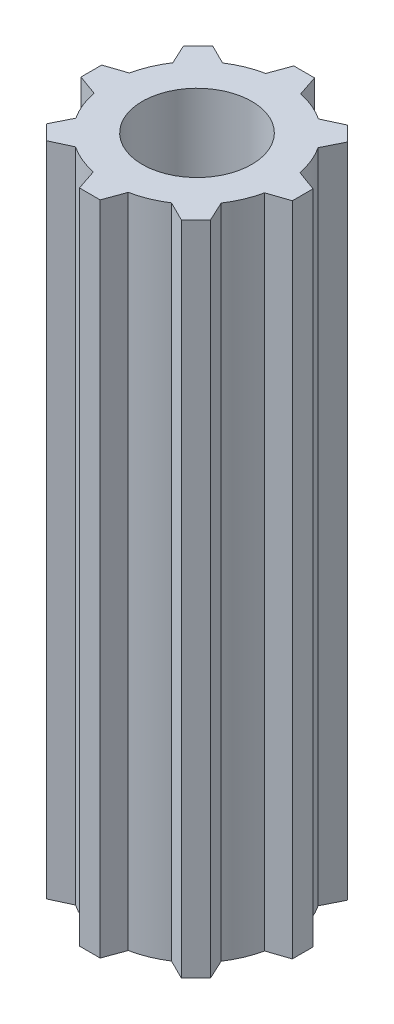
ISO-10303-21;
HEADER;
FILE_DESCRIPTION(('STEP AP214'),'2;1');
FILE_NAME('part.step','',(''),(''),'','','');
FILE_SCHEMA(('AUTOMOTIVE_DESIGN { 1 0 10303 214 1 1 1 1 }'));
ENDSEC;
DATA;
#1=APPLICATION_CONTEXT('core data for automotive mechanical design processes');
#2=APPLICATION_PROTOCOL_DEFINITION('international standard','automotive_design',2000,#1);
#3=PRODUCT_CONTEXT('',#1,'mechanical');
#4=PRODUCT('Part','Part','',(#3));
#5=PRODUCT_RELATED_PRODUCT_CATEGORY('part','',(#4));
#6=PRODUCT_DEFINITION_FORMATION('','',#4);
#7=PRODUCT_DEFINITION_CONTEXT('part definition',#1,'design');
#8=PRODUCT_DEFINITION('design','',#6,#7);
#9=PRODUCT_DEFINITION_SHAPE('','',#8);
#10=(LENGTH_UNIT() NAMED_UNIT(*) SI_UNIT(.MILLI.,.METRE.));
#11=(NAMED_UNIT(*) PLANE_ANGLE_UNIT() SI_UNIT($,.RADIAN.));
#12=(NAMED_UNIT(*) SI_UNIT($,.STERADIAN.) SOLID_ANGLE_UNIT());
#13=UNCERTAINTY_MEASURE_WITH_UNIT(LENGTH_MEASURE(1.E-05),#10,'distance_accuracy_value','');
#14=(GEOMETRIC_REPRESENTATION_CONTEXT(3) GLOBAL_UNCERTAINTY_ASSIGNED_CONTEXT((#13)) GLOBAL_UNIT_ASSIGNED_CONTEXT((#10,
#11,#12)) REPRESENTATION_CONTEXT('',''));
#15=CARTESIAN_POINT('',(0.,0.,0.));
#16=DIRECTION('',(0.,0.,1.));
#17=DIRECTION('',(1.,0.,0.));
#18=AXIS2_PLACEMENT_3D('',#15,#16,#17);
#19=CARTESIAN_POINT('',(0.,38.1,0.));
#20=DIRECTION('',(0.,-1.,0.));
#21=DIRECTION('',(0.,0.,-1.));
#22=AXIS2_PLACEMENT_3D('',#19,#20,#21);
#23=CYLINDRICAL_SURFACE('',#22,5.08);
#24=CARTESIAN_POINT('',(0.,0.,0.));
#25=DIRECTION('',(0.,1.,0.));
#26=DIRECTION('',(0.,0.,1.));
#27=AXIS2_PLACEMENT_3D('',#24,#25,#26);
#28=CIRCLE('',#27,5.08);
#29=CARTESIAN_POINT('',(2.82151602166992,0.,-4.22438721466912));
#30=VERTEX_POINT('',#29);
#31=CARTESIAN_POINT('',(1.04749297734917,0.,-4.97083076179467));
#32=VERTEX_POINT('',#31);
#33=EDGE_CURVE('E279',#30,#32,#28,.T.);
#34=ORIENTED_EDGE('',*,*,#33,.T.);
#35=DIRECTION('',(0.,-1.,0.));
#36=VECTOR('',#35,1.);
#37=CARTESIAN_POINT('',(1.04749297734917,38.1,-4.97083076179467));
#38=LINE('',#37,#36);
#39=CARTESIAN_POINT('',(1.04749297734917,38.1,-4.97083076179467));
#40=VERTEX_POINT('',#39);
#41=EDGE_CURVE('E11',#40,#32,#38,.T.);
#42=ORIENTED_EDGE('',*,*,#41,.F.);
#43=CARTESIAN_POINT('',(0.,38.1,0.));
#44=DIRECTION('',(0.,1.,0.));
#45=DIRECTION('',(0.,0.,1.));
#46=AXIS2_PLACEMENT_3D('',#43,#44,#45);
#47=CIRCLE('',#46,5.08);
#48=CARTESIAN_POINT('',(2.82151602166992,38.1,-4.22438721466912));
#49=VERTEX_POINT('',#48);
#50=EDGE_CURVE('E342',#49,#40,#47,.T.);
#51=ORIENTED_EDGE('',*,*,#50,.F.);
#52=DIRECTION('',(0.,-1.,0.));
#53=VECTOR('',#52,1.);
#54=CARTESIAN_POINT('',(2.82151602166992,38.1,-4.22438721466912));
#55=LINE('',#54,#53);
#56=EDGE_CURVE('E275',#49,#30,#55,.T.);
#57=ORIENTED_EDGE('',*,*,#56,.T.);
#58=EDGE_LOOP('',(#34,#42,#51,#57));
#59=FACE_BOUND('',#58,.T.);
#60=ADVANCED_FACE('F39',(#59),#23,.T.);
#61=CARTESIAN_POINT('',(1.04749297734917,38.1,-4.97083076179467));
#62=DIRECTION('',(-0.948425843861846,0.,0.316999083113728));
#63=DIRECTION('',(0.316999083113728,0.,0.948425843861847));
#64=AXIS2_PLACEMENT_3D('',#61,#62,#63);
#65=PLANE('',#64);
#66=DIRECTION('',(-0.316999083113728,0.,-0.948425843861846));
#67=VECTOR('',#66,1.);
#68=CARTESIAN_POINT('',(1.04749297734917,0.,-4.97083076179467));
#69=LINE('',#68,#67);
#70=CARTESIAN_POINT('',(0.644904141794734,0.,-6.17533158349921));
#71=VERTEX_POINT('',#70);
#72=EDGE_CURVE('E282',#32,#71,#69,.T.);
#73=ORIENTED_EDGE('',*,*,#72,.T.);
#74=DIRECTION('',(0.,-1.,0.));
#75=VECTOR('',#74,1.);
#76=CARTESIAN_POINT('',(0.644904141794734,38.1,-6.17533158349921));
#77=LINE('',#76,#75);
#78=CARTESIAN_POINT('',(0.644904141794734,38.1,-6.17533158349921));
#79=VERTEX_POINT('',#78);
#80=EDGE_CURVE('E47',#79,#71,#77,.T.);
#81=ORIENTED_EDGE('',*,*,#80,.F.);
#82=DIRECTION('',(-0.316999083113728,0.,-0.948425843861846));
#83=VECTOR('',#82,1.);
#84=CARTESIAN_POINT('',(1.04749297734917,38.1,-4.97083076179467));
#85=LINE('',#84,#83);
#86=EDGE_CURVE('E170',#40,#79,#85,.T.);
#87=ORIENTED_EDGE('',*,*,#86,.F.);
#88=ORIENTED_EDGE('',*,*,#41,.T.);
#89=EDGE_LOOP('',(#73,#81,#87,#88));
#90=FACE_BOUND('',#89,.T.);
#91=ADVANCED_FACE('F521',(#90),#65,.F.);
#92=CARTESIAN_POINT('',(0.644904141794734,38.1,-6.17533158349921));
#93=DIRECTION('',(0.,0.,1.));
#94=DIRECTION('',(1.,0.,0.));
#95=AXIS2_PLACEMENT_3D('',#92,#93,#94);
#96=PLANE('',#95);
#97=DIRECTION('',(-1.,0.,0.));
#98=VECTOR('',#97,1.);
#99=CARTESIAN_POINT('',(0.644904141794734,0.,-6.17533158349921));
#100=LINE('',#99,#98);
#101=CARTESIAN_POINT('',(-0.556834652404989,0.,-6.17533158349921));
#102=VERTEX_POINT('',#101);
#103=EDGE_CURVE('E285',#71,#102,#100,.T.);
#104=ORIENTED_EDGE('',*,*,#103,.T.);
#105=DIRECTION('',(0.,-1.,0.));
#106=VECTOR('',#105,1.);
#107=CARTESIAN_POINT('',(-0.556834652404989,38.1,-6.17533158349921));
#108=LINE('',#107,#106);
#109=CARTESIAN_POINT('',(-0.556834652404989,38.1,-6.17533158349921));
#110=VERTEX_POINT('',#109);
#111=EDGE_CURVE('E421',#110,#102,#108,.T.);
#112=ORIENTED_EDGE('',*,*,#111,.F.);
#113=DIRECTION('',(-1.,0.,0.));
#114=VECTOR('',#113,1.);
#115=CARTESIAN_POINT('',(0.644904141794734,38.1,-6.17533158349921));
#116=LINE('',#115,#114);
#117=EDGE_CURVE('E429',#79,#110,#116,.T.);
#118=ORIENTED_EDGE('',*,*,#117,.F.);
#119=ORIENTED_EDGE('',*,*,#80,.T.);
#120=EDGE_LOOP('',(#104,#112,#118,#119));
#121=FACE_BOUND('',#120,.T.);
#122=ADVANCED_FACE('F427',(#121),#96,.F.);
#123=CARTESIAN_POINT('',(-0.991979733700994,38.1,-4.98220595799958));
#124=DIRECTION('',(0.939468996456405,0.,0.342633922280319));
#125=DIRECTION('',(0.342633922280319,0.,-0.939468996456405));
#126=AXIS2_PLACEMENT_3D('',#123,#124,#125);
#127=PLANE('',#126);
#128=DIRECTION('',(-0.342633922280319,0.,0.939468996456405));
#129=VECTOR('',#128,1.);
#130=CARTESIAN_POINT('',(-0.991979733700994,0.,-4.98220595799958));
#131=LINE('',#130,#129);
#132=CARTESIAN_POINT('',(-0.991979733700992,0.,-4.98220595799958));
#133=VERTEX_POINT('',#132);
#134=EDGE_CURVE('E287',#102,#133,#131,.T.);
#135=ORIENTED_EDGE('',*,*,#134,.T.);
#136=DIRECTION('',(0.,-1.,0.));
#137=VECTOR('',#136,1.);
#138=CARTESIAN_POINT('',(-0.991979733700992,38.1,-4.98220595799958));
#139=LINE('',#138,#137);
#140=CARTESIAN_POINT('',(-0.991979733700992,38.1,-4.98220595799958));
#141=VERTEX_POINT('',#140);
#142=EDGE_CURVE('E418',#141,#133,#139,.T.);
#143=ORIENTED_EDGE('',*,*,#142,.F.);
#144=DIRECTION('',(-0.342633922280319,0.,0.939468996456405));
#145=VECTOR('',#144,1.);
#146=CARTESIAN_POINT('',(-0.991979733700994,38.1,-4.98220595799958));
#147=LINE('',#146,#145);
#148=EDGE_CURVE('E447',#110,#141,#147,.T.);
#149=ORIENTED_EDGE('',*,*,#148,.F.);
#150=ORIENTED_EDGE('',*,*,#111,.T.);
#151=EDGE_LOOP('',(#135,#143,#149,#150));
#152=FACE_BOUND('',#151,.T.);
#153=ADVANCED_FACE('F438',(#152),#127,.F.);
#154=CARTESIAN_POINT('',(0.,38.1,0.));
#155=DIRECTION('',(0.,-1.,0.));
#156=DIRECTION('',(0.,0.,-1.));
#157=AXIS2_PLACEMENT_3D('',#154,#155,#156);
#158=CYLINDRICAL_SURFACE('',#157,5.08);
#159=CARTESIAN_POINT('',(0.,0.,0.));
#160=DIRECTION('',(0.,1.,0.));
#161=DIRECTION('',(0.,0.,1.));
#162=AXIS2_PLACEMENT_3D('',#159,#160,#161);
#163=CIRCLE('',#162,5.08);
#164=CARTESIAN_POINT('',(-2.77421875226682,0.,-4.25559752732459));
#165=VERTEX_POINT('',#164);
#166=EDGE_CURVE('E289',#133,#165,#163,.T.);
#167=ORIENTED_EDGE('',*,*,#166,.T.);
#168=DIRECTION('',(0.,-1.,0.));
#169=VECTOR('',#168,1.);
#170=CARTESIAN_POINT('',(-2.77421875226682,38.1,-4.25559752732459));
#171=LINE('',#170,#169);
#172=CARTESIAN_POINT('',(-2.77421875226682,38.1,-4.25559752732459));
#173=VERTEX_POINT('',#172);
#174=EDGE_CURVE('E415',#173,#165,#171,.T.);
#175=ORIENTED_EDGE('',*,*,#174,.F.);
#176=CARTESIAN_POINT('',(0.,38.1,0.));
#177=DIRECTION('',(0.,1.,0.));
#178=DIRECTION('',(0.,0.,1.));
#179=AXIS2_PLACEMENT_3D('',#176,#177,#178);
#180=CIRCLE('',#179,5.08);
#181=EDGE_CURVE('E444',#141,#173,#180,.T.);
#182=ORIENTED_EDGE('',*,*,#181,.F.);
#183=ORIENTED_EDGE('',*,*,#142,.T.);
#184=EDGE_LOOP('',(#167,#175,#182,#183));
#185=FACE_BOUND('',#184,.T.);
#186=ADVANCED_FACE('F442',(#185),#158,.T.);
#187=CARTESIAN_POINT('',(-2.77421875226682,38.1,-4.25559752732459));
#188=DIRECTION('',(-0.44648614434765,0.,0.89479054694692));
#189=DIRECTION('',(0.894790546946921,0.,0.446486144347651));
#190=AXIS2_PLACEMENT_3D('',#187,#188,#189);
#191=PLANE('',#190);
#192=DIRECTION('',(-0.89479054694692,0.,-0.44648614434765));
#193=VECTOR('',#192,1.);
#194=CARTESIAN_POINT('',(-2.77421875226682,0.,-4.25559752732459));
#195=LINE('',#194,#193);
#196=CARTESIAN_POINT('',(-3.91060274688941,0.,-4.8226349306461));
#197=VERTEX_POINT('',#196);
#198=EDGE_CURVE('E291',#165,#197,#195,.T.);
#199=ORIENTED_EDGE('',*,*,#198,.T.);
#200=DIRECTION('',(0.,-1.,0.));
#201=VECTOR('',#200,1.);
#202=CARTESIAN_POINT('',(-3.91060274688941,38.1,-4.8226349306461));
#203=LINE('',#202,#201);
#204=CARTESIAN_POINT('',(-3.91060274688941,38.1,-4.8226349306461));
#205=VERTEX_POINT('',#204);
#206=EDGE_CURVE('E412',#205,#197,#203,.T.);
#207=ORIENTED_EDGE('',*,*,#206,.F.);
#208=DIRECTION('',(-0.89479054694692,0.,-0.44648614434765));
#209=VECTOR('',#208,1.);
#210=CARTESIAN_POINT('',(-2.77421875226682,38.1,-4.25559752732459));
#211=LINE('',#210,#209);
#212=EDGE_CURVE('E446',#173,#205,#211,.T.);
#213=ORIENTED_EDGE('',*,*,#212,.F.);
#214=ORIENTED_EDGE('',*,*,#174,.T.);
#215=EDGE_LOOP('',(#199,#207,#213,#214));
#216=FACE_BOUND('',#215,.T.);
#217=ADVANCED_FACE('F534',(#216),#191,.F.);
#218=CARTESIAN_POINT('',(-3.91060274688941,38.1,-4.8226349306461));
#219=DIRECTION('',(0.707106781186548,0.,0.707106781186547));
#220=DIRECTION('',(0.707106781186547,0.,-0.707106781186548));
#221=AXIS2_PLACEMENT_3D('',#218,#219,#220);
#222=PLANE('',#221);
#223=DIRECTION('',(-0.707106781186547,0.,0.707106781186548));
#224=VECTOR('',#223,1.);
#225=CARTESIAN_POINT('',(-3.91060274688941,0.,-4.8226349306461));
#226=LINE('',#225,#224);
#227=CARTESIAN_POINT('',(-4.76036039748298,0.,-3.97287728005253));
#228=VERTEX_POINT('',#227);
#229=EDGE_CURVE('E293',#197,#228,#226,.T.);
#230=ORIENTED_EDGE('',*,*,#229,.T.);
#231=DIRECTION('',(0.,-1.,0.));
#232=VECTOR('',#231,1.);
#233=CARTESIAN_POINT('',(-4.76036039748298,38.1,-3.97287728005253));
#234=LINE('',#233,#232);
#235=CARTESIAN_POINT('',(-4.76036039748298,38.1,-3.97287728005253));
#236=VERTEX_POINT('',#235);
#237=EDGE_CURVE('E409',#236,#228,#234,.T.);
#238=ORIENTED_EDGE('',*,*,#237,.F.);
#239=DIRECTION('',(-0.707106781186547,0.,0.707106781186548));
#240=VECTOR('',#239,1.);
#241=CARTESIAN_POINT('',(-3.91060274688941,38.1,-4.8226349306461));
#242=LINE('',#241,#240);
#243=EDGE_CURVE('E449',#205,#236,#242,.T.);
#244=ORIENTED_EDGE('',*,*,#243,.F.);
#245=ORIENTED_EDGE('',*,*,#206,.T.);
#246=EDGE_LOOP('',(#230,#238,#244,#245));
#247=FACE_BOUND('',#246,.T.);
#248=ADVANCED_FACE('F537',(#247),#222,.F.);
#249=CARTESIAN_POINT('',(-4.22438721466912,38.1,-2.82151602166992));
#250=DIRECTION('',(0.906583668017802,0.,-0.422026128199886));
#251=DIRECTION('',(-0.422026128199886,0.,-0.906583668017803));
#252=AXIS2_PLACEMENT_3D('',#249,#250,#251);
#253=PLANE('',#252);
#254=DIRECTION('',(0.422026128199886,0.,0.906583668017802));
#255=VECTOR('',#254,1.);
#256=CARTESIAN_POINT('',(-4.22438721466912,0.,-2.82151602166992));
#257=LINE('',#256,#255);
#258=CARTESIAN_POINT('',(-4.22438721466912,0.,-2.82151602166993));
#259=VERTEX_POINT('',#258);
#260=EDGE_CURVE('E295',#228,#259,#257,.T.);
#261=ORIENTED_EDGE('',*,*,#260,.T.);
#262=DIRECTION('',(0.,-1.,0.));
#263=VECTOR('',#262,1.);
#264=CARTESIAN_POINT('',(-4.22438721466912,38.1,-2.82151602166993));
#265=LINE('',#264,#263);
#266=CARTESIAN_POINT('',(-4.22438721466912,38.1,-2.82151602166993));
#267=VERTEX_POINT('',#266);
#268=EDGE_CURVE('E406',#267,#259,#265,.T.);
#269=ORIENTED_EDGE('',*,*,#268,.F.);
#270=DIRECTION('',(0.422026128199886,0.,0.906583668017802));
#271=VECTOR('',#270,1.);
#272=CARTESIAN_POINT('',(-4.22438721466912,38.1,-2.82151602166992));
#273=LINE('',#272,#271);
#274=EDGE_CURVE('E455',#236,#267,#273,.T.);
#275=ORIENTED_EDGE('',*,*,#274,.F.);
#276=ORIENTED_EDGE('',*,*,#237,.T.);
#277=EDGE_LOOP('',(#261,#269,#275,#276));
#278=FACE_BOUND('',#277,.T.);
#279=ADVANCED_FACE('F541',(#278),#253,.F.);
#280=CARTESIAN_POINT('',(0.,38.1,0.));
#281=DIRECTION('',(0.,-1.,0.));
#282=DIRECTION('',(0.,0.,-1.));
#283=AXIS2_PLACEMENT_3D('',#280,#281,#282);
#284=CYLINDRICAL_SURFACE('',#283,5.08);
#285=CARTESIAN_POINT('',(0.,0.,0.));
#286=DIRECTION('',(0.,1.,0.));
#287=DIRECTION('',(0.,0.,1.));
#288=AXIS2_PLACEMENT_3D('',#285,#286,#287);
#289=CIRCLE('',#288,5.08);
#290=CARTESIAN_POINT('',(-4.97083076179467,0.,-1.04749297734917));
#291=VERTEX_POINT('',#290);
#292=EDGE_CURVE('E297',#259,#291,#289,.T.);
#293=ORIENTED_EDGE('',*,*,#292,.T.);
#294=DIRECTION('',(0.,-1.,0.));
#295=VECTOR('',#294,1.);
#296=CARTESIAN_POINT('',(-4.97083076179467,38.1,-1.04749297734917));
#297=LINE('',#296,#295);
#298=CARTESIAN_POINT('',(-4.97083076179467,38.1,-1.04749297734917));
#299=VERTEX_POINT('',#298);
#300=EDGE_CURVE('E403',#299,#291,#297,.T.);
#301=ORIENTED_EDGE('',*,*,#300,.F.);
#302=CARTESIAN_POINT('',(0.,38.1,0.));
#303=DIRECTION('',(0.,1.,0.));
#304=DIRECTION('',(0.,0.,1.));
#305=AXIS2_PLACEMENT_3D('',#302,#303,#304);
#306=CIRCLE('',#305,5.08);
#307=EDGE_CURVE('E457',#267,#299,#306,.T.);
#308=ORIENTED_EDGE('',*,*,#307,.F.);
#309=ORIENTED_EDGE('',*,*,#268,.T.);
#310=EDGE_LOOP('',(#293,#301,#308,#309));
#311=FACE_BOUND('',#310,.T.);
#312=ADVANCED_FACE('F545',(#311),#284,.T.);
#313=CARTESIAN_POINT('',(-4.97083076179467,38.1,-1.04749297734917));
#314=DIRECTION('',(0.316999083113728,0.,0.948425843861847));
#315=DIRECTION('',(0.948425843861847,0.,-0.316999083113728));
#316=AXIS2_PLACEMENT_3D('',#313,#314,#315);
#317=PLANE('',#316);
#318=DIRECTION('',(-0.948425843861846,0.,0.316999083113728));
#319=VECTOR('',#318,1.);
#320=CARTESIAN_POINT('',(-4.97083076179467,0.,-1.04749297734917));
#321=LINE('',#320,#319);
#322=CARTESIAN_POINT('',(-6.17533158349921,0.,-0.644904141794736));
#323=VERTEX_POINT('',#322);
#324=EDGE_CURVE('E299',#291,#323,#321,.T.);
#325=ORIENTED_EDGE('',*,*,#324,.T.);
#326=DIRECTION('',(0.,-1.,0.));
#327=VECTOR('',#326,1.);
#328=CARTESIAN_POINT('',(-6.17533158349921,38.1,-0.644904141794736));
#329=LINE('',#328,#327);
#330=CARTESIAN_POINT('',(-6.17533158349921,38.1,-0.644904141794736));
#331=VERTEX_POINT('',#330);
#332=EDGE_CURVE('E400',#331,#323,#329,.T.);
#333=ORIENTED_EDGE('',*,*,#332,.F.);
#334=DIRECTION('',(-0.948425843861846,0.,0.316999083113728));
#335=VECTOR('',#334,1.);
#336=CARTESIAN_POINT('',(-4.97083076179467,38.1,-1.04749297734917));
#337=LINE('',#336,#335);
#338=EDGE_CURVE('E459',#299,#331,#337,.T.);
#339=ORIENTED_EDGE('',*,*,#338,.F.);
#340=ORIENTED_EDGE('',*,*,#300,.T.);
#341=EDGE_LOOP('',(#325,#333,#339,#340));
#342=FACE_BOUND('',#341,.T.);
#343=ADVANCED_FACE('F549',(#342),#317,.F.);
#344=CARTESIAN_POINT('',(-6.17533158349921,38.1,-0.644904141794736));
#345=DIRECTION('',(1.,0.,0.));
#346=DIRECTION('',(0.,0.,-1.));
#347=AXIS2_PLACEMENT_3D('',#344,#345,#346);
#348=PLANE('',#347);
#349=DIRECTION('',(0.,0.,1.));
#350=VECTOR('',#349,1.);
#351=CARTESIAN_POINT('',(-6.17533158349921,0.,-0.644904141794736));
#352=LINE('',#351,#350);
#353=CARTESIAN_POINT('',(-6.17533158349921,0.,0.556834652404988));
#354=VERTEX_POINT('',#353);
#355=EDGE_CURVE('E301',#323,#354,#352,.T.);
#356=ORIENTED_EDGE('',*,*,#355,.T.);
#357=DIRECTION('',(0.,-1.,0.));
#358=VECTOR('',#357,1.);
#359=CARTESIAN_POINT('',(-6.17533158349921,38.1,0.556834652404988));
#360=LINE('',#359,#358);
#361=CARTESIAN_POINT('',(-6.17533158349921,38.1,0.556834652404988));
#362=VERTEX_POINT('',#361);
#363=EDGE_CURVE('E397',#362,#354,#360,.T.);
#364=ORIENTED_EDGE('',*,*,#363,.F.);
#365=DIRECTION('',(0.,0.,1.));
#366=VECTOR('',#365,1.);
#367=CARTESIAN_POINT('',(-6.17533158349921,38.1,-0.644904141794736));
#368=LINE('',#367,#366);
#369=EDGE_CURVE('E461',#331,#362,#368,.T.);
#370=ORIENTED_EDGE('',*,*,#369,.F.);
#371=ORIENTED_EDGE('',*,*,#332,.T.);
#372=EDGE_LOOP('',(#356,#364,#370,#371));
#373=FACE_BOUND('',#372,.T.);
#374=ADVANCED_FACE('F553',(#373),#348,.F.);
#375=CARTESIAN_POINT('',(-4.98220595799958,38.1,0.991979733700992));
#376=DIRECTION('',(0.342633922280319,0.,-0.939468996456405));
#377=DIRECTION('',(-0.939468996456405,0.,-0.342633922280319));
#378=AXIS2_PLACEMENT_3D('',#375,#376,#377);
#379=PLANE('',#378);
#380=DIRECTION('',(0.939468996456405,0.,0.342633922280319));
#381=VECTOR('',#380,1.);
#382=CARTESIAN_POINT('',(-4.98220595799958,0.,0.991979733700992));
#383=LINE('',#382,#381);
#384=CARTESIAN_POINT('',(-4.98220595799958,0.,0.99197973370099));
#385=VERTEX_POINT('',#384);
#386=EDGE_CURVE('E303',#354,#385,#383,.T.);
#387=ORIENTED_EDGE('',*,*,#386,.T.);
#388=DIRECTION('',(0.,-1.,0.));
#389=VECTOR('',#388,1.);
#390=CARTESIAN_POINT('',(-4.98220595799958,38.1,0.99197973370099));
#391=LINE('',#390,#389);
#392=CARTESIAN_POINT('',(-4.98220595799958,38.1,0.99197973370099));
#393=VERTEX_POINT('',#392);
#394=EDGE_CURVE('E394',#393,#385,#391,.T.);
#395=ORIENTED_EDGE('',*,*,#394,.F.);
#396=DIRECTION('',(0.939468996456405,0.,0.342633922280319));
#397=VECTOR('',#396,1.);
#398=CARTESIAN_POINT('',(-4.98220595799958,38.1,0.991979733700992));
#399=LINE('',#398,#397);
#400=EDGE_CURVE('E463',#362,#393,#399,.T.);
#401=ORIENTED_EDGE('',*,*,#400,.F.);
#402=ORIENTED_EDGE('',*,*,#363,.T.);
#403=EDGE_LOOP('',(#387,#395,#401,#402));
#404=FACE_BOUND('',#403,.T.);
#405=ADVANCED_FACE('F557',(#404),#379,.F.);
#406=CARTESIAN_POINT('',(0.,38.1,0.));
#407=DIRECTION('',(0.,-1.,0.));
#408=DIRECTION('',(0.,0.,-1.));
#409=AXIS2_PLACEMENT_3D('',#406,#407,#408);
#410=CYLINDRICAL_SURFACE('',#409,5.08);
#411=CARTESIAN_POINT('',(0.,0.,0.));
#412=DIRECTION('',(0.,1.,0.));
#413=DIRECTION('',(0.,0.,1.));
#414=AXIS2_PLACEMENT_3D('',#411,#412,#413);
#415=CIRCLE('',#414,5.08);
#416=CARTESIAN_POINT('',(-4.25559752732459,0.,2.77421875226682));
#417=VERTEX_POINT('',#416);
#418=EDGE_CURVE('E305',#385,#417,#415,.T.);
#419=ORIENTED_EDGE('',*,*,#418,.T.);
#420=DIRECTION('',(0.,-1.,0.));
#421=VECTOR('',#420,1.);
#422=CARTESIAN_POINT('',(-4.25559752732459,38.1,2.77421875226682));
#423=LINE('',#422,#421);
#424=CARTESIAN_POINT('',(-4.25559752732459,38.1,2.77421875226682));
#425=VERTEX_POINT('',#424);
#426=EDGE_CURVE('E391',#425,#417,#423,.T.);
#427=ORIENTED_EDGE('',*,*,#426,.F.);
#428=CARTESIAN_POINT('',(0.,38.1,0.));
#429=DIRECTION('',(0.,1.,0.));
#430=DIRECTION('',(0.,0.,1.));
#431=AXIS2_PLACEMENT_3D('',#428,#429,#430);
#432=CIRCLE('',#431,5.08);
#433=EDGE_CURVE('E465',#393,#425,#432,.T.);
#434=ORIENTED_EDGE('',*,*,#433,.F.);
#435=ORIENTED_EDGE('',*,*,#394,.T.);
#436=EDGE_LOOP('',(#419,#427,#434,#435));
#437=FACE_BOUND('',#436,.T.);
#438=ADVANCED_FACE('F561',(#437),#410,.T.);
#439=CARTESIAN_POINT('',(-4.25559752732459,38.1,2.77421875226682));
#440=DIRECTION('',(0.89479054694692,0.,0.446486144347651));
#441=DIRECTION('',(0.446486144347651,0.,-0.89479054694692));
#442=AXIS2_PLACEMENT_3D('',#439,#440,#441);
#443=PLANE('',#442);
#444=DIRECTION('',(-0.446486144347651,0.,0.89479054694692));
#445=VECTOR('',#444,1.);
#446=CARTESIAN_POINT('',(-4.25559752732459,0.,2.77421875226682));
#447=LINE('',#446,#445);
#448=CARTESIAN_POINT('',(-4.8226349306461,0.,3.9106027468894));
#449=VERTEX_POINT('',#448);
#450=EDGE_CURVE('E307',#417,#449,#447,.T.);
#451=ORIENTED_EDGE('',*,*,#450,.T.);
#452=DIRECTION('',(0.,-1.,0.));
#453=VECTOR('',#452,1.);
#454=CARTESIAN_POINT('',(-4.8226349306461,38.1,3.9106027468894));
#455=LINE('',#454,#453);
#456=CARTESIAN_POINT('',(-4.8226349306461,38.1,3.9106027468894));
#457=VERTEX_POINT('',#456);
#458=EDGE_CURVE('E388',#457,#449,#455,.T.);
#459=ORIENTED_EDGE('',*,*,#458,.F.);
#460=DIRECTION('',(-0.446486144347651,0.,0.89479054694692));
#461=VECTOR('',#460,1.);
#462=CARTESIAN_POINT('',(-4.25559752732459,38.1,2.77421875226682));
#463=LINE('',#462,#461);
#464=EDGE_CURVE('E467',#425,#457,#463,.T.);
#465=ORIENTED_EDGE('',*,*,#464,.F.);
#466=ORIENTED_EDGE('',*,*,#426,.T.);
#467=EDGE_LOOP('',(#451,#459,#465,#466));
#468=FACE_BOUND('',#467,.T.);
#469=ADVANCED_FACE('F565',(#468),#443,.F.);
#470=CARTESIAN_POINT('',(-4.8226349306461,38.1,3.9106027468894));
#471=DIRECTION('',(0.707106781186548,0.,-0.707106781186547));
#472=DIRECTION('',(-0.707106781186547,0.,-0.707106781186548));
#473=AXIS2_PLACEMENT_3D('',#470,#471,#472);
#474=PLANE('',#473);
#475=DIRECTION('',(0.707106781186547,0.,0.707106781186548));
#476=VECTOR('',#475,1.);
#477=CARTESIAN_POINT('',(-4.8226349306461,0.,3.9106027468894));
#478=LINE('',#477,#476);
#479=CARTESIAN_POINT('',(-3.97287728005253,0.,4.76036039748297));
#480=VERTEX_POINT('',#479);
#481=EDGE_CURVE('E309',#449,#480,#478,.T.);
#482=ORIENTED_EDGE('',*,*,#481,.T.);
#483=DIRECTION('',(0.,-1.,0.));
#484=VECTOR('',#483,1.);
#485=CARTESIAN_POINT('',(-3.97287728005253,38.1,4.76036039748297));
#486=LINE('',#485,#484);
#487=CARTESIAN_POINT('',(-3.97287728005253,38.1,4.76036039748297));
#488=VERTEX_POINT('',#487);
#489=EDGE_CURVE('E385',#488,#480,#486,.T.);
#490=ORIENTED_EDGE('',*,*,#489,.F.);
#491=DIRECTION('',(0.707106781186547,0.,0.707106781186548));
#492=VECTOR('',#491,1.);
#493=CARTESIAN_POINT('',(-4.8226349306461,38.1,3.9106027468894));
#494=LINE('',#493,#492);
#495=EDGE_CURVE('E469',#457,#488,#494,.T.);
#496=ORIENTED_EDGE('',*,*,#495,.F.);
#497=ORIENTED_EDGE('',*,*,#458,.T.);
#498=EDGE_LOOP('',(#482,#490,#496,#497));
#499=FACE_BOUND('',#498,.T.);
#500=ADVANCED_FACE('F569',(#499),#474,.F.);
#501=CARTESIAN_POINT('',(-2.82151602166992,38.1,4.22438721466912));
#502=DIRECTION('',(-0.422026128199886,0.,-0.906583668017803));
#503=DIRECTION('',(-0.906583668017803,0.,0.422026128199886));
#504=AXIS2_PLACEMENT_3D('',#501,#502,#503);
#505=PLANE('',#504);
#506=DIRECTION('',(0.906583668017803,0.,-0.422026128199886));
#507=VECTOR('',#506,1.);
#508=CARTESIAN_POINT('',(-2.82151602166992,0.,4.22438721466912));
#509=LINE('',#508,#507);
#510=CARTESIAN_POINT('',(-2.82151602166993,0.,4.22438721466911));
#511=VERTEX_POINT('',#510);
#512=EDGE_CURVE('E311',#480,#511,#509,.T.);
#513=ORIENTED_EDGE('',*,*,#512,.T.);
#514=DIRECTION('',(0.,-1.,0.));
#515=VECTOR('',#514,1.);
#516=CARTESIAN_POINT('',(-2.82151602166993,38.1,4.22438721466911));
#517=LINE('',#516,#515);
#518=CARTESIAN_POINT('',(-2.82151602166993,38.1,4.22438721466911));
#519=VERTEX_POINT('',#518);
#520=EDGE_CURVE('E382',#519,#511,#517,.T.);
#521=ORIENTED_EDGE('',*,*,#520,.F.);
#522=DIRECTION('',(0.906583668017803,0.,-0.422026128199886));
#523=VECTOR('',#522,1.);
#524=CARTESIAN_POINT('',(-2.82151602166992,38.1,4.22438721466912));
#525=LINE('',#524,#523);
#526=EDGE_CURVE('E471',#488,#519,#525,.T.);
#527=ORIENTED_EDGE('',*,*,#526,.F.);
#528=ORIENTED_EDGE('',*,*,#489,.T.);
#529=EDGE_LOOP('',(#513,#521,#527,#528));
#530=FACE_BOUND('',#529,.T.);
#531=ADVANCED_FACE('F573',(#530),#505,.F.);
#532=CARTESIAN_POINT('',(0.,38.1,0.));
#533=DIRECTION('',(0.,-1.,0.));
#534=DIRECTION('',(0.,0.,-1.));
#535=AXIS2_PLACEMENT_3D('',#532,#533,#534);
#536=CYLINDRICAL_SURFACE('',#535,5.08);
#537=CARTESIAN_POINT('',(0.,0.,0.));
#538=DIRECTION('',(0.,1.,0.));
#539=DIRECTION('',(0.,0.,1.));
#540=AXIS2_PLACEMENT_3D('',#537,#538,#539);
#541=CIRCLE('',#540,5.08);
#542=CARTESIAN_POINT('',(-1.04749297734917,0.,4.97083076179466));
#543=VERTEX_POINT('',#542);
#544=EDGE_CURVE('E313',#511,#543,#541,.T.);
#545=ORIENTED_EDGE('',*,*,#544,.T.);
#546=DIRECTION('',(0.,-1.,0.));
#547=VECTOR('',#546,1.);
#548=CARTESIAN_POINT('',(-1.04749297734917,38.1,4.97083076179466));
#549=LINE('',#548,#547);
#550=CARTESIAN_POINT('',(-1.04749297734917,38.1,4.97083076179466));
#551=VERTEX_POINT('',#550);
#552=EDGE_CURVE('E379',#551,#543,#549,.T.);
#553=ORIENTED_EDGE('',*,*,#552,.F.);
#554=CARTESIAN_POINT('',(0.,38.1,0.));
#555=DIRECTION('',(0.,1.,0.));
#556=DIRECTION('',(0.,0.,1.));
#557=AXIS2_PLACEMENT_3D('',#554,#555,#556);
#558=CIRCLE('',#557,5.08);
#559=EDGE_CURVE('E473',#519,#551,#558,.T.);
#560=ORIENTED_EDGE('',*,*,#559,.F.);
#561=ORIENTED_EDGE('',*,*,#520,.T.);
#562=EDGE_LOOP('',(#545,#553,#560,#561));
#563=FACE_BOUND('',#562,.T.);
#564=ADVANCED_FACE('F577',(#563),#536,.T.);
#565=CARTESIAN_POINT('',(-1.04749297734917,38.1,4.97083076179466));
#566=DIRECTION('',(0.948425843861847,0.,-0.316999083113728));
#567=DIRECTION('',(-0.316999083113728,0.,-0.948425843861847));
#568=AXIS2_PLACEMENT_3D('',#565,#566,#567);
#569=PLANE('',#568);
#570=DIRECTION('',(0.316999083113728,0.,0.948425843861846));
#571=VECTOR('',#570,1.);
#572=CARTESIAN_POINT('',(-1.04749297734917,0.,4.97083076179466));
#573=LINE('',#572,#571);
#574=CARTESIAN_POINT('',(-0.644904141794736,0.,6.17533158349921));
#575=VERTEX_POINT('',#574);
#576=EDGE_CURVE('E315',#543,#575,#573,.T.);
#577=ORIENTED_EDGE('',*,*,#576,.T.);
#578=DIRECTION('',(0.,-1.,0.));
#579=VECTOR('',#578,1.);
#580=CARTESIAN_POINT('',(-0.644904141794736,38.1,6.17533158349921));
#581=LINE('',#580,#579);
#582=CARTESIAN_POINT('',(-0.644904141794736,38.1,6.17533158349921));
#583=VERTEX_POINT('',#582);
#584=EDGE_CURVE('E376',#583,#575,#581,.T.);
#585=ORIENTED_EDGE('',*,*,#584,.F.);
#586=DIRECTION('',(0.316999083113728,0.,0.948425843861846));
#587=VECTOR('',#586,1.);
#588=CARTESIAN_POINT('',(-1.04749297734917,38.1,4.97083076179466));
#589=LINE('',#588,#587);
#590=EDGE_CURVE('E475',#551,#583,#589,.T.);
#591=ORIENTED_EDGE('',*,*,#590,.F.);
#592=ORIENTED_EDGE('',*,*,#552,.T.);
#593=EDGE_LOOP('',(#577,#585,#591,#592));
#594=FACE_BOUND('',#593,.T.);
#595=ADVANCED_FACE('F581',(#594),#569,.F.);
#596=CARTESIAN_POINT('',(-0.644904141794736,38.1,6.17533158349921));
#597=DIRECTION('',(0.,0.,-1.));
#598=DIRECTION('',(-1.,0.,0.));
#599=AXIS2_PLACEMENT_3D('',#596,#597,#598);
#600=PLANE('',#599);
#601=DIRECTION('',(1.,0.,0.));
#602=VECTOR('',#601,1.);
#603=CARTESIAN_POINT('',(-0.644904141794736,0.,6.17533158349921));
#604=LINE('',#603,#602);
#605=CARTESIAN_POINT('',(0.55683465240498,0.,6.17533158349923));
#606=VERTEX_POINT('',#605);
#607=EDGE_CURVE('E317',#575,#606,#604,.T.);
#608=ORIENTED_EDGE('',*,*,#607,.T.);
#609=DIRECTION('',(0.,-1.,0.));
#610=VECTOR('',#609,1.);
#611=CARTESIAN_POINT('',(0.55683465240498,38.1,6.17533158349923));
#612=LINE('',#611,#610);
#613=CARTESIAN_POINT('',(0.55683465240498,38.1,6.17533158349923));
#614=VERTEX_POINT('',#613);
#615=EDGE_CURVE('E373',#614,#606,#612,.T.);
#616=ORIENTED_EDGE('',*,*,#615,.F.);
#617=DIRECTION('',(1.,0.,0.));
#618=VECTOR('',#617,1.);
#619=CARTESIAN_POINT('',(-0.644904141794736,38.1,6.17533158349921));
#620=LINE('',#619,#618);
#621=EDGE_CURVE('E477',#583,#614,#620,.T.);
#622=ORIENTED_EDGE('',*,*,#621,.F.);
#623=ORIENTED_EDGE('',*,*,#584,.T.);
#624=EDGE_LOOP('',(#608,#616,#622,#623));
#625=FACE_BOUND('',#624,.T.);
#626=ADVANCED_FACE('F585',(#625),#600,.F.);
#627=CARTESIAN_POINT('',(0.991979733700993,38.1,4.98220595799958));
#628=DIRECTION('',(-0.939468996456405,0.,-0.342633922280318));
#629=DIRECTION('',(-0.342633922280318,0.,0.939468996456405));
#630=AXIS2_PLACEMENT_3D('',#627,#628,#629);
#631=PLANE('',#630);
#632=DIRECTION('',(0.342633922280318,0.,-0.939468996456405));
#633=VECTOR('',#632,1.);
#634=CARTESIAN_POINT('',(0.991979733700993,0.,4.98220595799958));
#635=LINE('',#634,#633);
#636=CARTESIAN_POINT('',(0.991979733700992,0.,4.98220595799958));
#637=VERTEX_POINT('',#636);
#638=EDGE_CURVE('E319',#606,#637,#635,.T.);
#639=ORIENTED_EDGE('',*,*,#638,.T.);
#640=DIRECTION('',(0.,-1.,0.));
#641=VECTOR('',#640,1.);
#642=CARTESIAN_POINT('',(0.991979733700992,38.1,4.98220595799958));
#643=LINE('',#642,#641);
#644=CARTESIAN_POINT('',(0.991979733700992,38.1,4.98220595799958));
#645=VERTEX_POINT('',#644);
#646=EDGE_CURVE('E370',#645,#637,#643,.T.);
#647=ORIENTED_EDGE('',*,*,#646,.F.);
#648=DIRECTION('',(0.342633922280318,0.,-0.939468996456405));
#649=VECTOR('',#648,1.);
#650=CARTESIAN_POINT('',(0.991979733700993,38.1,4.98220595799958));
#651=LINE('',#650,#649);
#652=EDGE_CURVE('E479',#614,#645,#651,.T.);
#653=ORIENTED_EDGE('',*,*,#652,.F.);
#654=ORIENTED_EDGE('',*,*,#615,.T.);
#655=EDGE_LOOP('',(#639,#647,#653,#654));
#656=FACE_BOUND('',#655,.T.);
#657=ADVANCED_FACE('F589',(#656),#631,.F.);
#658=CARTESIAN_POINT('',(0.,38.1,0.));
#659=DIRECTION('',(0.,-1.,0.));
#660=DIRECTION('',(0.,0.,-1.));
#661=AXIS2_PLACEMENT_3D('',#658,#659,#660);
#662=CYLINDRICAL_SURFACE('',#661,5.08);
#663=CARTESIAN_POINT('',(0.,0.,0.));
#664=DIRECTION('',(0.,1.,0.));
#665=DIRECTION('',(0.,0.,1.));
#666=AXIS2_PLACEMENT_3D('',#663,#664,#665);
#667=CIRCLE('',#666,5.08);
#668=CARTESIAN_POINT('',(2.77421875226682,0.,4.25559752732458));
#669=VERTEX_POINT('',#668);
#670=EDGE_CURVE('E321',#637,#669,#667,.T.);
#671=ORIENTED_EDGE('',*,*,#670,.T.);
#672=DIRECTION('',(0.,-1.,0.));
#673=VECTOR('',#672,1.);
#674=CARTESIAN_POINT('',(2.77421875226682,38.1,4.25559752732458));
#675=LINE('',#674,#673);
#676=CARTESIAN_POINT('',(2.77421875226682,38.1,4.25559752732458));
#677=VERTEX_POINT('',#676);
#678=EDGE_CURVE('E367',#677,#669,#675,.T.);
#679=ORIENTED_EDGE('',*,*,#678,.F.);
#680=CARTESIAN_POINT('',(0.,38.1,0.));
#681=DIRECTION('',(0.,1.,0.));
#682=DIRECTION('',(0.,0.,1.));
#683=AXIS2_PLACEMENT_3D('',#680,#681,#682);
#684=CIRCLE('',#683,5.08);
#685=EDGE_CURVE('E481',#645,#677,#684,.T.);
#686=ORIENTED_EDGE('',*,*,#685,.F.);
#687=ORIENTED_EDGE('',*,*,#646,.T.);
#688=EDGE_LOOP('',(#671,#679,#686,#687));
#689=FACE_BOUND('',#688,.T.);
#690=ADVANCED_FACE('F593',(#689),#662,.T.);
#691=CARTESIAN_POINT('',(2.77421875226682,38.1,4.25559752732458));
#692=DIRECTION('',(0.446486144347651,0.,-0.89479054694692));
#693=DIRECTION('',(-0.89479054694692,0.,-0.446486144347651));
#694=AXIS2_PLACEMENT_3D('',#691,#692,#693);
#695=PLANE('',#694);
#696=DIRECTION('',(0.89479054694692,0.,0.446486144347651));
#697=VECTOR('',#696,1.);
#698=CARTESIAN_POINT('',(2.77421875226682,0.,4.25559752732458));
#699=LINE('',#698,#697);
#700=CARTESIAN_POINT('',(3.9106027468894,0.,4.8226349306461));
#701=VERTEX_POINT('',#700);
#702=EDGE_CURVE('E323',#669,#701,#699,.T.);
#703=ORIENTED_EDGE('',*,*,#702,.T.);
#704=DIRECTION('',(0.,-1.,0.));
#705=VECTOR('',#704,1.);
#706=CARTESIAN_POINT('',(3.9106027468894,38.1,4.8226349306461));
#707=LINE('',#706,#705);
#708=CARTESIAN_POINT('',(3.9106027468894,38.1,4.8226349306461));
#709=VERTEX_POINT('',#708);
#710=EDGE_CURVE('E364',#709,#701,#707,.T.);
#711=ORIENTED_EDGE('',*,*,#710,.F.);
#712=DIRECTION('',(0.89479054694692,0.,0.446486144347651));
#713=VECTOR('',#712,1.);
#714=CARTESIAN_POINT('',(2.77421875226682,38.1,4.25559752732458));
#715=LINE('',#714,#713);
#716=EDGE_CURVE('E483',#677,#709,#715,.T.);
#717=ORIENTED_EDGE('',*,*,#716,.F.);
#718=ORIENTED_EDGE('',*,*,#678,.T.);
#719=EDGE_LOOP('',(#703,#711,#717,#718));
#720=FACE_BOUND('',#719,.T.);
#721=ADVANCED_FACE('F597',(#720),#695,.F.);
#722=CARTESIAN_POINT('',(3.9106027468894,38.1,4.8226349306461));
#723=DIRECTION('',(-0.707106781186547,0.,-0.707106781186547));
#724=DIRECTION('',(-0.707106781186548,0.,0.707106781186548));
#725=AXIS2_PLACEMENT_3D('',#722,#723,#724);
#726=PLANE('',#725);
#727=DIRECTION('',(0.707106781186547,0.,-0.707106781186547));
#728=VECTOR('',#727,1.);
#729=CARTESIAN_POINT('',(3.9106027468894,0.,4.8226349306461));
#730=LINE('',#729,#728);
#731=CARTESIAN_POINT('',(4.76036039748297,0.,3.97287728005253));
#732=VERTEX_POINT('',#731);
#733=EDGE_CURVE('E325',#701,#732,#730,.T.);
#734=ORIENTED_EDGE('',*,*,#733,.T.);
#735=DIRECTION('',(0.,-1.,0.));
#736=VECTOR('',#735,1.);
#737=CARTESIAN_POINT('',(4.76036039748297,38.1,3.97287728005253));
#738=LINE('',#737,#736);
#739=CARTESIAN_POINT('',(4.76036039748297,38.1,3.97287728005253));
#740=VERTEX_POINT('',#739);
#741=EDGE_CURVE('E361',#740,#732,#738,.T.);
#742=ORIENTED_EDGE('',*,*,#741,.F.);
#743=DIRECTION('',(0.707106781186547,0.,-0.707106781186547));
#744=VECTOR('',#743,1.);
#745=CARTESIAN_POINT('',(3.9106027468894,38.1,4.8226349306461));
#746=LINE('',#745,#744);
#747=EDGE_CURVE('E485',#709,#740,#746,.T.);
#748=ORIENTED_EDGE('',*,*,#747,.F.);
#749=ORIENTED_EDGE('',*,*,#710,.T.);
#750=EDGE_LOOP('',(#734,#742,#748,#749));
#751=FACE_BOUND('',#750,.T.);
#752=ADVANCED_FACE('F601',(#751),#726,.F.);
#753=CARTESIAN_POINT('',(4.22438721466912,38.1,2.82151602166992));
#754=DIRECTION('',(-0.906583668017802,0.,0.422026128199887));
#755=DIRECTION('',(0.422026128199887,0.,0.906583668017802));
#756=AXIS2_PLACEMENT_3D('',#753,#754,#755);
#757=PLANE('',#756);
#758=DIRECTION('',(-0.422026128199887,0.,-0.906583668017802));
#759=VECTOR('',#758,1.);
#760=CARTESIAN_POINT('',(4.22438721466912,0.,2.82151602166992));
#761=LINE('',#760,#759);
#762=CARTESIAN_POINT('',(4.22438721466912,0.,2.82151602166992));
#763=VERTEX_POINT('',#762);
#764=EDGE_CURVE('E327',#732,#763,#761,.T.);
#765=ORIENTED_EDGE('',*,*,#764,.T.);
#766=DIRECTION('',(0.,-1.,0.));
#767=VECTOR('',#766,1.);
#768=CARTESIAN_POINT('',(4.22438721466912,38.1,2.82151602166992));
#769=LINE('',#768,#767);
#770=CARTESIAN_POINT('',(4.22438721466912,38.1,2.82151602166992));
#771=VERTEX_POINT('',#770);
#772=EDGE_CURVE('E358',#771,#763,#769,.T.);
#773=ORIENTED_EDGE('',*,*,#772,.F.);
#774=DIRECTION('',(-0.422026128199887,0.,-0.906583668017802));
#775=VECTOR('',#774,1.);
#776=CARTESIAN_POINT('',(4.22438721466912,38.1,2.82151602166992));
#777=LINE('',#776,#775);
#778=EDGE_CURVE('E487',#740,#771,#777,.T.);
#779=ORIENTED_EDGE('',*,*,#778,.F.);
#780=ORIENTED_EDGE('',*,*,#741,.T.);
#781=EDGE_LOOP('',(#765,#773,#779,#780));
#782=FACE_BOUND('',#781,.T.);
#783=ADVANCED_FACE('F605',(#782),#757,.F.);
#784=CARTESIAN_POINT('',(0.,38.1,0.));
#785=DIRECTION('',(0.,-1.,0.));
#786=DIRECTION('',(0.,0.,-1.));
#787=AXIS2_PLACEMENT_3D('',#784,#785,#786);
#788=CYLINDRICAL_SURFACE('',#787,5.08);
#789=CARTESIAN_POINT('',(0.,0.,0.));
#790=DIRECTION('',(0.,1.,0.));
#791=DIRECTION('',(0.,0.,1.));
#792=AXIS2_PLACEMENT_3D('',#789,#790,#791);
#793=CIRCLE('',#792,5.08);
#794=CARTESIAN_POINT('',(4.97083076179467,0.,1.04749297734917));
#795=VERTEX_POINT('',#794);
#796=EDGE_CURVE('E329',#763,#795,#793,.T.);
#797=ORIENTED_EDGE('',*,*,#796,.T.);
#798=DIRECTION('',(0.,-1.,0.));
#799=VECTOR('',#798,1.);
#800=CARTESIAN_POINT('',(4.97083076179467,38.1,1.04749297734917));
#801=LINE('',#800,#799);
#802=CARTESIAN_POINT('',(4.97083076179467,38.1,1.04749297734917));
#803=VERTEX_POINT('',#802);
#804=EDGE_CURVE('E355',#803,#795,#801,.T.);
#805=ORIENTED_EDGE('',*,*,#804,.F.);
#806=CARTESIAN_POINT('',(0.,38.1,0.));
#807=DIRECTION('',(0.,1.,0.));
#808=DIRECTION('',(0.,0.,1.));
#809=AXIS2_PLACEMENT_3D('',#806,#807,#808);
#810=CIRCLE('',#809,5.08);
#811=EDGE_CURVE('E489',#771,#803,#810,.T.);
#812=ORIENTED_EDGE('',*,*,#811,.F.);
#813=ORIENTED_EDGE('',*,*,#772,.T.);
#814=EDGE_LOOP('',(#797,#805,#812,#813));
#815=FACE_BOUND('',#814,.T.);
#816=ADVANCED_FACE('F609',(#815),#788,.T.);
#817=CARTESIAN_POINT('',(4.97083076179467,38.1,1.04749297734917));
#818=DIRECTION('',(-0.316999083113728,0.,-0.948425843861847));
#819=DIRECTION('',(-0.948425843861847,0.,0.316999083113728));
#820=AXIS2_PLACEMENT_3D('',#817,#818,#819);
#821=PLANE('',#820);
#822=DIRECTION('',(0.948425843861846,0.,-0.316999083113728));
#823=VECTOR('',#822,1.);
#824=CARTESIAN_POINT('',(4.97083076179467,0.,1.04749297734917));
#825=LINE('',#824,#823);
#826=CARTESIAN_POINT('',(6.17533158349921,0.,0.644904141794733));
#827=VERTEX_POINT('',#826);
#828=EDGE_CURVE('E331',#795,#827,#825,.T.);
#829=ORIENTED_EDGE('',*,*,#828,.T.);
#830=DIRECTION('',(0.,-1.,0.));
#831=VECTOR('',#830,1.);
#832=CARTESIAN_POINT('',(6.17533158349921,38.1,0.644904141794733));
#833=LINE('',#832,#831);
#834=CARTESIAN_POINT('',(6.17533158349921,38.1,0.644904141794733));
#835=VERTEX_POINT('',#834);
#836=EDGE_CURVE('E352',#835,#827,#833,.T.);
#837=ORIENTED_EDGE('',*,*,#836,.F.);
#838=DIRECTION('',(0.948425843861846,0.,-0.316999083113728));
#839=VECTOR('',#838,1.);
#840=CARTESIAN_POINT('',(4.97083076179467,38.1,1.04749297734917));
#841=LINE('',#840,#839);
#842=EDGE_CURVE('E491',#803,#835,#841,.T.);
#843=ORIENTED_EDGE('',*,*,#842,.F.);
#844=ORIENTED_EDGE('',*,*,#804,.T.);
#845=EDGE_LOOP('',(#829,#837,#843,#844));
#846=FACE_BOUND('',#845,.T.);
#847=ADVANCED_FACE('F613',(#846),#821,.F.);
#848=CARTESIAN_POINT('',(6.17533158349921,38.1,0.644904141794733));
#849=DIRECTION('',(-1.,0.,0.));
#850=DIRECTION('',(0.,0.,1.));
#851=AXIS2_PLACEMENT_3D('',#848,#849,#850);
#852=PLANE('',#851);
#853=DIRECTION('',(0.,0.,-1.));
#854=VECTOR('',#853,1.);
#855=CARTESIAN_POINT('',(6.17533158349921,0.,0.644904141794733));
#856=LINE('',#855,#854);
#857=CARTESIAN_POINT('',(6.17533158349921,0.,-0.55683465240499));
#858=VERTEX_POINT('',#857);
#859=EDGE_CURVE('E333',#827,#858,#856,.T.);
#860=ORIENTED_EDGE('',*,*,#859,.T.);
#861=DIRECTION('',(0.,-1.,0.));
#862=VECTOR('',#861,1.);
#863=CARTESIAN_POINT('',(6.17533158349921,38.1,-0.55683465240499));
#864=LINE('',#863,#862);
#865=CARTESIAN_POINT('',(6.17533158349921,38.1,-0.55683465240499));
#866=VERTEX_POINT('',#865);
#867=EDGE_CURVE('E349',#866,#858,#864,.T.);
#868=ORIENTED_EDGE('',*,*,#867,.F.);
#869=DIRECTION('',(0.,0.,-1.));
#870=VECTOR('',#869,1.);
#871=CARTESIAN_POINT('',(6.17533158349921,38.1,0.644904141794733));
#872=LINE('',#871,#870);
#873=EDGE_CURVE('E493',#835,#866,#872,.T.);
#874=ORIENTED_EDGE('',*,*,#873,.F.);
#875=ORIENTED_EDGE('',*,*,#836,.T.);
#876=EDGE_LOOP('',(#860,#868,#874,#875));
#877=FACE_BOUND('',#876,.T.);
#878=ADVANCED_FACE('F617',(#877),#852,.F.);
#879=CARTESIAN_POINT('',(4.98220595799958,38.1,-0.991979733700995));
#880=DIRECTION('',(-0.342633922280319,0.,0.939468996456405));
#881=DIRECTION('',(0.939468996456405,0.,0.342633922280319));
#882=AXIS2_PLACEMENT_3D('',#879,#880,#881);
#883=PLANE('',#882);
#884=DIRECTION('',(-0.939468996456405,0.,-0.342633922280319));
#885=VECTOR('',#884,1.);
#886=CARTESIAN_POINT('',(4.98220595799958,0.,-0.991979733700995));
#887=LINE('',#886,#885);
#888=CARTESIAN_POINT('',(4.98220595799958,0.,-0.991979733700996));
#889=VERTEX_POINT('',#888);
#890=EDGE_CURVE('E335',#858,#889,#887,.T.);
#891=ORIENTED_EDGE('',*,*,#890,.T.);
#892=DIRECTION('',(0.,-1.,0.));
#893=VECTOR('',#892,1.);
#894=CARTESIAN_POINT('',(4.98220595799958,38.1,-0.991979733700996));
#895=LINE('',#894,#893);
#896=CARTESIAN_POINT('',(4.98220595799958,38.1,-0.991979733700996));
#897=VERTEX_POINT('',#896);
#898=EDGE_CURVE('E346',#897,#889,#895,.T.);
#899=ORIENTED_EDGE('',*,*,#898,.F.);
#900=DIRECTION('',(-0.939468996456405,0.,-0.342633922280319));
#901=VECTOR('',#900,1.);
#902=CARTESIAN_POINT('',(4.98220595799958,38.1,-0.991979733700995));
#903=LINE('',#902,#901);
#904=EDGE_CURVE('E495',#866,#897,#903,.T.);
#905=ORIENTED_EDGE('',*,*,#904,.F.);
#906=ORIENTED_EDGE('',*,*,#867,.T.);
#907=EDGE_LOOP('',(#891,#899,#905,#906));
#908=FACE_BOUND('',#907,.T.);
#909=ADVANCED_FACE('F501',(#908),#883,.F.);
#910=CARTESIAN_POINT('',(0.,38.1,0.));
#911=DIRECTION('',(0.,-1.,0.));
#912=DIRECTION('',(0.,0.,-1.));
#913=AXIS2_PLACEMENT_3D('',#910,#911,#912);
#914=CYLINDRICAL_SURFACE('',#913,5.08);
#915=CARTESIAN_POINT('',(0.,0.,0.));
#916=DIRECTION('',(0.,1.,0.));
#917=DIRECTION('',(0.,0.,1.));
#918=AXIS2_PLACEMENT_3D('',#915,#916,#917);
#919=CIRCLE('',#918,5.08);
#920=CARTESIAN_POINT('',(4.25559752732459,0.,-2.77421875226682));
#921=VERTEX_POINT('',#920);
#922=EDGE_CURVE('E337',#889,#921,#919,.T.);
#923=ORIENTED_EDGE('',*,*,#922,.T.);
#924=DIRECTION('',(0.,-1.,0.));
#925=VECTOR('',#924,1.);
#926=CARTESIAN_POINT('',(4.25559752732459,38.1,-2.77421875226682));
#927=LINE('',#926,#925);
#928=CARTESIAN_POINT('',(4.25559752732459,38.1,-2.77421875226682));
#929=VERTEX_POINT('',#928);
#930=EDGE_CURVE('E270',#929,#921,#927,.T.);
#931=ORIENTED_EDGE('',*,*,#930,.F.);
#932=CARTESIAN_POINT('',(0.,38.1,0.));
#933=DIRECTION('',(0.,1.,0.));
#934=DIRECTION('',(0.,0.,1.));
#935=AXIS2_PLACEMENT_3D('',#932,#933,#934);
#936=CIRCLE('',#935,5.08);
#937=EDGE_CURVE('E261',#897,#929,#936,.T.);
#938=ORIENTED_EDGE('',*,*,#937,.F.);
#939=ORIENTED_EDGE('',*,*,#898,.T.);
#940=EDGE_LOOP('',(#923,#931,#938,#939));
#941=FACE_BOUND('',#940,.T.);
#942=ADVANCED_FACE('F505',(#941),#914,.T.);
#943=CARTESIAN_POINT('',(4.25559752732459,38.1,-2.77421875226682));
#944=DIRECTION('',(-0.89479054694692,0.,-0.44648614434765));
#945=DIRECTION('',(-0.446486144347651,0.,0.894790546946921));
#946=AXIS2_PLACEMENT_3D('',#943,#944,#945);
#947=PLANE('',#946);
#948=DIRECTION('',(0.44648614434765,0.,-0.89479054694692));
#949=VECTOR('',#948,1.);
#950=CARTESIAN_POINT('',(4.25559752732459,0.,-2.77421875226682));
#951=LINE('',#950,#949);
#952=CARTESIAN_POINT('',(4.8226349306461,0.,-3.91060274688941));
#953=VERTEX_POINT('',#952);
#954=EDGE_CURVE('E269',#921,#953,#951,.T.);
#955=ORIENTED_EDGE('',*,*,#954,.T.);
#956=DIRECTION('',(0.,-1.,0.));
#957=VECTOR('',#956,1.);
#958=CARTESIAN_POINT('',(4.8226349306461,38.1,-3.91060274688941));
#959=LINE('',#958,#957);
#960=CARTESIAN_POINT('',(4.8226349306461,38.1,-3.91060274688941));
#961=VERTEX_POINT('',#960);
#962=EDGE_CURVE('E266',#961,#953,#959,.T.);
#963=ORIENTED_EDGE('',*,*,#962,.F.);
#964=DIRECTION('',(0.44648614434765,0.,-0.89479054694692));
#965=VECTOR('',#964,1.);
#966=CARTESIAN_POINT('',(4.25559752732459,38.1,-2.77421875226682));
#967=LINE('',#966,#965);
#968=EDGE_CURVE('E255',#929,#961,#967,.T.);
#969=ORIENTED_EDGE('',*,*,#968,.F.);
#970=ORIENTED_EDGE('',*,*,#930,.T.);
#971=EDGE_LOOP('',(#955,#963,#969,#970));
#972=FACE_BOUND('',#971,.T.);
#973=ADVANCED_FACE('F267',(#972),#947,.F.);
#974=CARTESIAN_POINT('',(4.8226349306461,38.1,-3.91060274688941));
#975=DIRECTION('',(-0.707106781186547,0.,0.707106781186547));
#976=DIRECTION('',(0.707106781186548,0.,0.707106781186548));
#977=AXIS2_PLACEMENT_3D('',#974,#975,#976);
#978=PLANE('',#977);
#979=DIRECTION('',(-0.707106781186547,0.,-0.707106781186547));
#980=VECTOR('',#979,1.);
#981=CARTESIAN_POINT('',(4.8226349306461,0.,-3.91060274688941));
#982=LINE('',#981,#980);
#983=CARTESIAN_POINT('',(3.97287728005253,0.,-4.76036039748298));
#984=VERTEX_POINT('',#983);
#985=EDGE_CURVE('E156',#953,#984,#982,.T.);
#986=ORIENTED_EDGE('',*,*,#985,.T.);
#987=DIRECTION('',(0.,-1.,0.));
#988=VECTOR('',#987,1.);
#989=CARTESIAN_POINT('',(3.97287728005253,38.1,-4.76036039748298));
#990=LINE('',#989,#988);
#991=CARTESIAN_POINT('',(3.97287728005253,38.1,-4.76036039748298));
#992=VERTEX_POINT('',#991);
#993=EDGE_CURVE('E271',#992,#984,#990,.T.);
#994=ORIENTED_EDGE('',*,*,#993,.F.);
#995=DIRECTION('',(-0.707106781186547,0.,-0.707106781186547));
#996=VECTOR('',#995,1.);
#997=CARTESIAN_POINT('',(4.8226349306461,38.1,-3.91060274688941));
#998=LINE('',#997,#996);
#999=EDGE_CURVE('E259',#961,#992,#998,.T.);
#1000=ORIENTED_EDGE('',*,*,#999,.F.);
#1001=ORIENTED_EDGE('',*,*,#962,.T.);
#1002=EDGE_LOOP('',(#986,#994,#1000,#1001));
#1003=FACE_BOUND('',#1002,.T.);
#1004=ADVANCED_FACE('F273',(#1003),#978,.F.);
#1005=CARTESIAN_POINT('',(2.82151602166992,38.1,-4.22438721466912));
#1006=DIRECTION('',(0.422026128199886,0.,0.906583668017803));
#1007=DIRECTION('',(0.906583668017803,0.,-0.422026128199886));
#1008=AXIS2_PLACEMENT_3D('',#1005,#1006,#1007);
#1009=PLANE('',#1008);
#1010=DIRECTION('',(-0.906583668017803,0.,0.422026128199886));
#1011=VECTOR('',#1010,1.);
#1012=CARTESIAN_POINT('',(2.82151602166992,0.,-4.22438721466912));
#1013=LINE('',#1012,#1011);
#1014=EDGE_CURVE('E162',#984,#30,#1013,.T.);
#1015=ORIENTED_EDGE('',*,*,#1014,.T.);
#1016=ORIENTED_EDGE('',*,*,#56,.F.);
#1017=DIRECTION('',(-0.906583668017803,0.,0.422026128199886));
#1018=VECTOR('',#1017,1.);
#1019=CARTESIAN_POINT('',(2.82151602166992,38.1,-4.22438721466912));
#1020=LINE('',#1019,#1018);
#1021=EDGE_CURVE('E55',#992,#49,#1020,.T.);
#1022=ORIENTED_EDGE('',*,*,#1021,.F.);
#1023=ORIENTED_EDGE('',*,*,#993,.T.);
#1024=EDGE_LOOP('',(#1015,#1016,#1022,#1023));
#1025=FACE_BOUND('',#1024,.T.);
#1026=ADVANCED_FACE('F509',(#1025),#1009,.F.);
#1027=CARTESIAN_POINT('',(0.,38.1,0.));
#1028=DIRECTION('',(0.,1.,0.));
#1029=DIRECTION('',(0.,0.,1.));
#1030=AXIS2_PLACEMENT_3D('',#1027,#1028,#1029);
#1031=PLANE('',#1030);
#1032=CARTESIAN_POINT('',(0.,38.1,0.));
#1033=DIRECTION('',(0.,1.,0.));
#1034=DIRECTION('',(0.,0.,1.));
#1035=AXIS2_PLACEMENT_3D('',#1032,#1033,#1034);
#1036=CIRCLE('',#1035,3.175);
#1037=CARTESIAN_POINT('',(0.,38.1,3.175));
#1038=VERTEX_POINT('',#1037);
#1039=EDGE_CURVE('E673',#1038,#1038,#1036,.T.);
#1040=ORIENTED_EDGE('',*,*,#1039,.F.);
#1041=EDGE_LOOP('',(#1040));
#1042=FACE_BOUND('',#1041,.T.);
#1043=ORIENTED_EDGE('',*,*,#50,.T.);
#1044=ORIENTED_EDGE('',*,*,#86,.T.);
#1045=ORIENTED_EDGE('',*,*,#117,.T.);
#1046=ORIENTED_EDGE('',*,*,#148,.T.);
#1047=ORIENTED_EDGE('',*,*,#181,.T.);
#1048=ORIENTED_EDGE('',*,*,#212,.T.);
#1049=ORIENTED_EDGE('',*,*,#243,.T.);
#1050=ORIENTED_EDGE('',*,*,#274,.T.);
#1051=ORIENTED_EDGE('',*,*,#307,.T.);
#1052=ORIENTED_EDGE('',*,*,#338,.T.);
#1053=ORIENTED_EDGE('',*,*,#369,.T.);
#1054=ORIENTED_EDGE('',*,*,#400,.T.);
#1055=ORIENTED_EDGE('',*,*,#433,.T.);
#1056=ORIENTED_EDGE('',*,*,#464,.T.);
#1057=ORIENTED_EDGE('',*,*,#495,.T.);
#1058=ORIENTED_EDGE('',*,*,#526,.T.);
#1059=ORIENTED_EDGE('',*,*,#559,.T.);
#1060=ORIENTED_EDGE('',*,*,#590,.T.);
#1061=ORIENTED_EDGE('',*,*,#621,.T.);
#1062=ORIENTED_EDGE('',*,*,#652,.T.);
#1063=ORIENTED_EDGE('',*,*,#685,.T.);
#1064=ORIENTED_EDGE('',*,*,#716,.T.);
#1065=ORIENTED_EDGE('',*,*,#747,.T.);
#1066=ORIENTED_EDGE('',*,*,#778,.T.);
#1067=ORIENTED_EDGE('',*,*,#811,.T.);
#1068=ORIENTED_EDGE('',*,*,#842,.T.);
#1069=ORIENTED_EDGE('',*,*,#873,.T.);
#1070=ORIENTED_EDGE('',*,*,#904,.T.);
#1071=ORIENTED_EDGE('',*,*,#937,.T.);
#1072=ORIENTED_EDGE('',*,*,#968,.T.);
#1073=ORIENTED_EDGE('',*,*,#999,.T.);
#1074=ORIENTED_EDGE('',*,*,#1021,.T.);
#1075=EDGE_LOOP('',(#1043,#1044,#1045,#1046,#1047,#1048,#1049,#1050,#1051,#1052,#1053,#1054,
#1055,#1056,#1057,#1058,#1059,#1060,#1061,#1062,#1063,#1064,#1065,#1066,#1067,#1068,#1069,#1070,
#1071,#1072,#1073,#1074));
#1076=FACE_BOUND('',#1075,.T.);
#1077=ADVANCED_FACE('F257',(#1042,#1076),#1031,.T.);
#1078=CARTESIAN_POINT('',(0.,0.,0.));
#1079=DIRECTION('',(0.,1.,0.));
#1080=DIRECTION('',(0.,0.,1.));
#1081=AXIS2_PLACEMENT_3D('',#1078,#1079,#1080);
#1082=PLANE('',#1081);
#1083=CARTESIAN_POINT('',(0.,0.,0.));
#1084=DIRECTION('',(0.,1.,0.));
#1085=DIRECTION('',(0.,0.,1.));
#1086=AXIS2_PLACEMENT_3D('',#1083,#1084,#1085);
#1087=CIRCLE('',#1086,3.175);
#1088=CARTESIAN_POINT('',(0.,0.,3.175));
#1089=VERTEX_POINT('',#1088);
#1090=EDGE_CURVE('E283',#1089,#1089,#1087,.T.);
#1091=ORIENTED_EDGE('',*,*,#1090,.T.);
#1092=EDGE_LOOP('',(#1091));
#1093=FACE_BOUND('',#1092,.T.);
#1094=ORIENTED_EDGE('',*,*,#33,.F.);
#1095=ORIENTED_EDGE('',*,*,#1014,.F.);
#1096=ORIENTED_EDGE('',*,*,#985,.F.);
#1097=ORIENTED_EDGE('',*,*,#954,.F.);
#1098=ORIENTED_EDGE('',*,*,#922,.F.);
#1099=ORIENTED_EDGE('',*,*,#890,.F.);
#1100=ORIENTED_EDGE('',*,*,#859,.F.);
#1101=ORIENTED_EDGE('',*,*,#828,.F.);
#1102=ORIENTED_EDGE('',*,*,#796,.F.);
#1103=ORIENTED_EDGE('',*,*,#764,.F.);
#1104=ORIENTED_EDGE('',*,*,#733,.F.);
#1105=ORIENTED_EDGE('',*,*,#702,.F.);
#1106=ORIENTED_EDGE('',*,*,#670,.F.);
#1107=ORIENTED_EDGE('',*,*,#638,.F.);
#1108=ORIENTED_EDGE('',*,*,#607,.F.);
#1109=ORIENTED_EDGE('',*,*,#576,.F.);
#1110=ORIENTED_EDGE('',*,*,#544,.F.);
#1111=ORIENTED_EDGE('',*,*,#512,.F.);
#1112=ORIENTED_EDGE('',*,*,#481,.F.);
#1113=ORIENTED_EDGE('',*,*,#450,.F.);
#1114=ORIENTED_EDGE('',*,*,#418,.F.);
#1115=ORIENTED_EDGE('',*,*,#386,.F.);
#1116=ORIENTED_EDGE('',*,*,#355,.F.);
#1117=ORIENTED_EDGE('',*,*,#324,.F.);
#1118=ORIENTED_EDGE('',*,*,#292,.F.);
#1119=ORIENTED_EDGE('',*,*,#260,.F.);
#1120=ORIENTED_EDGE('',*,*,#229,.F.);
#1121=ORIENTED_EDGE('',*,*,#198,.F.);
#1122=ORIENTED_EDGE('',*,*,#166,.F.);
#1123=ORIENTED_EDGE('',*,*,#134,.F.);
#1124=ORIENTED_EDGE('',*,*,#103,.F.);
#1125=ORIENTED_EDGE('',*,*,#72,.F.);
#1126=EDGE_LOOP('',(#1094,#1095,#1096,#1097,#1098,#1099,#1100,#1101,#1102,#1103,#1104,#1105,
#1106,#1107,#1108,#1109,#1110,#1111,#1112,#1113,#1114,#1115,#1116,#1117,#1118,#1119,#1120,#1121,
#1122,#1123,#1124,#1125));
#1127=FACE_BOUND('',#1126,.T.);
#1128=ADVANCED_FACE('F433',(#1093,#1127),#1082,.F.);
#1129=CARTESIAN_POINT('',(0.,0.,0.));
#1130=DIRECTION('',(0.,1.,0.));
#1131=DIRECTION('',(0.,0.,1.));
#1132=AXIS2_PLACEMENT_3D('',#1129,#1130,#1131);
#1133=CYLINDRICAL_SURFACE('',#1132,3.175);
#1134=ORIENTED_EDGE('',*,*,#1090,.F.);
#1135=EDGE_LOOP('',(#1134));
#1136=FACE_BOUND('',#1135,.T.);
#1137=ORIENTED_EDGE('',*,*,#1039,.T.);
#1138=EDGE_LOOP('',(#1137));
#1139=FACE_BOUND('',#1138,.T.);
#1140=ADVANCED_FACE('F656',(#1136,#1139),#1133,.F.);
#1141=CLOSED_SHELL('',(#60,#91,#122,#153,#186,#217,#248,#279,#312,#343,#374,#405,#438,#469,#500,
#531,#564,#595,#626,#657,#690,#721,#752,#783,#816,#847,#878,#909,#942,#973,#1004,#1026,#1077,
#1128,#1140));
#1142=MANIFOLD_SOLID_BREP('B2',#1141);
#1143=ADVANCED_BREP_SHAPE_REPRESENTATION('',(#18,#1142),#14);
#1144=SHAPE_DEFINITION_REPRESENTATION(#9,#1143);
ENDSEC;
END-ISO-10303-21;
